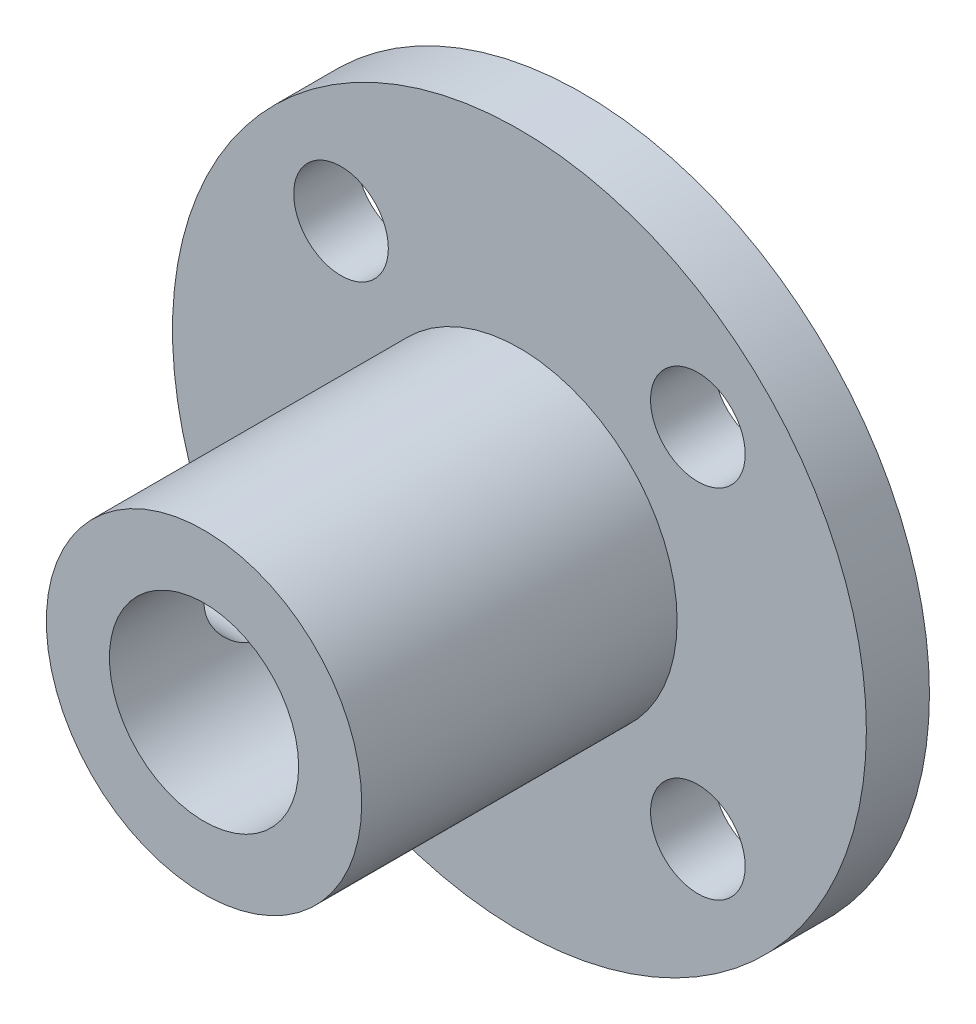
ISO-10303-21;
HEADER;
FILE_DESCRIPTION(('STEP AP214'),'2;1');
FILE_NAME('part.step','',(''),(''),'','','');
FILE_SCHEMA(('AUTOMOTIVE_DESIGN { 1 0 10303 214 1 1 1 1 }'));
ENDSEC;
DATA;
#1=APPLICATION_CONTEXT('core data for automotive mechanical design processes');
#2=APPLICATION_PROTOCOL_DEFINITION('international standard','automotive_design',2000,#1);
#3=PRODUCT_CONTEXT('',#1,'mechanical');
#4=PRODUCT('Part','Part','',(#3));
#5=PRODUCT_RELATED_PRODUCT_CATEGORY('part','',(#4));
#6=PRODUCT_DEFINITION_FORMATION('','',#4);
#7=PRODUCT_DEFINITION_CONTEXT('part definition',#1,'design');
#8=PRODUCT_DEFINITION('design','',#6,#7);
#9=PRODUCT_DEFINITION_SHAPE('','',#8);
#10=(LENGTH_UNIT() NAMED_UNIT(*) SI_UNIT(.MILLI.,.METRE.));
#11=(NAMED_UNIT(*) PLANE_ANGLE_UNIT() SI_UNIT($,.RADIAN.));
#12=(NAMED_UNIT(*) SI_UNIT($,.STERADIAN.) SOLID_ANGLE_UNIT());
#13=UNCERTAINTY_MEASURE_WITH_UNIT(LENGTH_MEASURE(1.E-05),#10,'distance_accuracy_value','');
#14=(GEOMETRIC_REPRESENTATION_CONTEXT(3) GLOBAL_UNCERTAINTY_ASSIGNED_CONTEXT((#13)) GLOBAL_UNIT_ASSIGNED_CONTEXT((#10,
#11,#12)) REPRESENTATION_CONTEXT('',''));
#15=CARTESIAN_POINT('',(0.,0.,0.));
#16=DIRECTION('',(0.,0.,1.));
#17=DIRECTION('',(1.,0.,0.));
#18=AXIS2_PLACEMENT_3D('',#15,#16,#17);
#19=CARTESIAN_POINT('',(0.,0.,2.));
#20=DIRECTION('',(0.,0.,-1.));
#21=DIRECTION('',(-1.,0.,0.));
#22=AXIS2_PLACEMENT_3D('',#19,#20,#21);
#23=CYLINDRICAL_SURFACE('',#22,11.);
#24=CARTESIAN_POINT('',(0.,0.,2.));
#25=DIRECTION('',(0.,0.,1.));
#26=DIRECTION('',(1.,0.,0.));
#27=AXIS2_PLACEMENT_3D('',#24,#25,#26);
#28=CIRCLE('',#27,11.);
#29=CARTESIAN_POINT('',(11.,0.,2.));
#30=VERTEX_POINT('',#29);
#31=EDGE_CURVE('E45',#30,#30,#28,.T.);
#32=ORIENTED_EDGE('',*,*,#31,.F.);
#33=EDGE_LOOP('',(#32));
#34=FACE_BOUND('',#33,.T.);
#35=CARTESIAN_POINT('',(0.,0.,0.));
#36=DIRECTION('',(0.,0.,1.));
#37=DIRECTION('',(1.,0.,0.));
#38=AXIS2_PLACEMENT_3D('',#35,#36,#37);
#39=CIRCLE('',#38,11.);
#40=CARTESIAN_POINT('',(11.,0.,0.));
#41=VERTEX_POINT('',#40);
#42=EDGE_CURVE('E50',#41,#41,#39,.T.);
#43=ORIENTED_EDGE('',*,*,#42,.T.);
#44=EDGE_LOOP('',(#43));
#45=FACE_BOUND('',#44,.T.);
#46=ADVANCED_FACE('F34',(#34,#45),#23,.T.);
#47=CARTESIAN_POINT('',(0.,0.,2.));
#48=DIRECTION('',(0.,0.,1.));
#49=DIRECTION('',(1.,0.,0.));
#50=AXIS2_PLACEMENT_3D('',#47,#48,#49);
#51=PLANE('',#50);
#52=CARTESIAN_POINT('',(-5.65685424949239,5.65685424949206,2.));
#53=DIRECTION('',(0.,0.,1.));
#54=DIRECTION('',(1.,0.,0.));
#55=AXIS2_PLACEMENT_3D('',#52,#53,#54);
#56=CIRCLE('',#55,1.50000000000034);
#57=CARTESIAN_POINT('',(-4.15685424949205,5.65685424949206,2.));
#58=VERTEX_POINT('',#57);
#59=EDGE_CURVE('E82',#58,#58,#56,.T.);
#60=ORIENTED_EDGE('',*,*,#59,.F.);
#61=EDGE_LOOP('',(#60));
#62=FACE_BOUND('',#61,.T.);
#63=CARTESIAN_POINT('',(-5.65685424949205,-5.6568542494927,2.));
#64=DIRECTION('',(0.,0.,1.));
#65=DIRECTION('',(1.,0.,0.));
#66=AXIS2_PLACEMENT_3D('',#63,#64,#65);
#67=CIRCLE('',#66,1.50000000000023);
#68=CARTESIAN_POINT('',(-4.15685424949182,-5.6568542494927,2.));
#69=VERTEX_POINT('',#68);
#70=EDGE_CURVE('E85',#69,#69,#67,.T.);
#71=ORIENTED_EDGE('',*,*,#70,.F.);
#72=EDGE_LOOP('',(#71));
#73=FACE_BOUND('',#72,.T.);
#74=CARTESIAN_POINT('',(5.6568542494927,-5.65685424949237,2.));
#75=DIRECTION('',(0.,0.,1.));
#76=DIRECTION('',(1.,0.,0.));
#77=AXIS2_PLACEMENT_3D('',#74,#75,#76);
#78=CIRCLE('',#77,1.49999999999992);
#79=CARTESIAN_POINT('',(7.15685424949263,-5.65685424949237,2.));
#80=VERTEX_POINT('',#79);
#81=EDGE_CURVE('E81',#80,#80,#78,.T.);
#82=ORIENTED_EDGE('',*,*,#81,.F.);
#83=EDGE_LOOP('',(#82));
#84=FACE_BOUND('',#83,.T.);
#85=CARTESIAN_POINT('',(5.65685424949237,5.65685424949239,2.));
#86=DIRECTION('',(0.,0.,1.));
#87=DIRECTION('',(1.,0.,0.));
#88=AXIS2_PLACEMENT_3D('',#85,#86,#87);
#89=CIRCLE('',#88,1.5);
#90=CARTESIAN_POINT('',(7.15685424949237,5.65685424949239,2.));
#91=VERTEX_POINT('',#90);
#92=EDGE_CURVE('E62',#91,#91,#89,.T.);
#93=ORIENTED_EDGE('',*,*,#92,.F.);
#94=EDGE_LOOP('',(#93));
#95=FACE_BOUND('',#94,.T.);
#96=CARTESIAN_POINT('',(0.,0.,2.));
#97=DIRECTION('',(0.,0.,1.));
#98=DIRECTION('',(1.,0.,0.));
#99=AXIS2_PLACEMENT_3D('',#96,#97,#98);
#100=CIRCLE('',#99,5.);
#101=CARTESIAN_POINT('',(5.,0.,2.));
#102=VERTEX_POINT('',#101);
#103=EDGE_CURVE('E10',#102,#102,#100,.T.);
#104=ORIENTED_EDGE('',*,*,#103,.F.);
#105=EDGE_LOOP('',(#104));
#106=FACE_BOUND('',#105,.T.);
#107=ORIENTED_EDGE('',*,*,#31,.T.);
#108=EDGE_LOOP('',(#107));
#109=FACE_BOUND('',#108,.T.);
#110=ADVANCED_FACE('F135',(#62,#73,#84,#95,#106,#109),#51,.T.);
#111=CARTESIAN_POINT('',(0.,0.,0.));
#112=DIRECTION('',(0.,0.,1.));
#113=DIRECTION('',(1.,0.,0.));
#114=AXIS2_PLACEMENT_3D('',#111,#112,#113);
#115=PLANE('',#114);
#116=CARTESIAN_POINT('',(-5.65685424949239,5.65685424949206,0.));
#117=DIRECTION('',(0.,0.,1.));
#118=DIRECTION('',(1.,0.,0.));
#119=AXIS2_PLACEMENT_3D('',#116,#117,#118);
#120=CIRCLE('',#119,1.50000000000034);
#121=CARTESIAN_POINT('',(-4.15685424949205,5.65685424949206,0.));
#122=VERTEX_POINT('',#121);
#123=EDGE_CURVE('E67',#122,#122,#120,.T.);
#124=ORIENTED_EDGE('',*,*,#123,.T.);
#125=EDGE_LOOP('',(#124));
#126=FACE_BOUND('',#125,.T.);
#127=CARTESIAN_POINT('',(-5.65685424949205,-5.6568542494927,0.));
#128=DIRECTION('',(0.,0.,1.));
#129=DIRECTION('',(1.,0.,0.));
#130=AXIS2_PLACEMENT_3D('',#127,#128,#129);
#131=CIRCLE('',#130,1.50000000000023);
#132=CARTESIAN_POINT('',(-4.15685424949182,-5.6568542494927,0.));
#133=VERTEX_POINT('',#132);
#134=EDGE_CURVE('E65',#133,#133,#131,.T.);
#135=ORIENTED_EDGE('',*,*,#134,.T.);
#136=EDGE_LOOP('',(#135));
#137=FACE_BOUND('',#136,.T.);
#138=CARTESIAN_POINT('',(5.6568542494927,-5.65685424949237,0.));
#139=DIRECTION('',(0.,0.,1.));
#140=DIRECTION('',(1.,0.,0.));
#141=AXIS2_PLACEMENT_3D('',#138,#139,#140);
#142=CIRCLE('',#141,1.49999999999992);
#143=CARTESIAN_POINT('',(7.15685424949263,-5.65685424949237,0.));
#144=VERTEX_POINT('',#143);
#145=EDGE_CURVE('E61',#144,#144,#142,.T.);
#146=ORIENTED_EDGE('',*,*,#145,.T.);
#147=EDGE_LOOP('',(#146));
#148=FACE_BOUND('',#147,.T.);
#149=CARTESIAN_POINT('',(5.65685424949237,5.65685424949239,0.));
#150=DIRECTION('',(0.,0.,1.));
#151=DIRECTION('',(1.,0.,0.));
#152=AXIS2_PLACEMENT_3D('',#149,#150,#151);
#153=CIRCLE('',#152,1.5);
#154=CARTESIAN_POINT('',(7.15685424949237,5.65685424949239,0.));
#155=VERTEX_POINT('',#154);
#156=EDGE_CURVE('E58',#155,#155,#153,.T.);
#157=ORIENTED_EDGE('',*,*,#156,.T.);
#158=EDGE_LOOP('',(#157));
#159=FACE_BOUND('',#158,.T.);
#160=CARTESIAN_POINT('',(0.,0.,0.));
#161=DIRECTION('',(0.,0.,1.));
#162=DIRECTION('',(1.,0.,0.));
#163=AXIS2_PLACEMENT_3D('',#160,#161,#162);
#164=CIRCLE('',#163,3.);
#165=CARTESIAN_POINT('',(3.,0.,0.));
#166=VERTEX_POINT('',#165);
#167=EDGE_CURVE('E69',#166,#166,#164,.T.);
#168=ORIENTED_EDGE('',*,*,#167,.T.);
#169=EDGE_LOOP('',(#168));
#170=FACE_BOUND('',#169,.T.);
#171=ORIENTED_EDGE('',*,*,#42,.F.);
#172=EDGE_LOOP('',(#171));
#173=FACE_BOUND('',#172,.T.);
#174=ADVANCED_FACE('F130',(#126,#137,#148,#159,#170,#173),#115,.F.);
#175=CARTESIAN_POINT('',(0.,0.,12.));
#176=DIRECTION('',(0.,0.,-1.));
#177=DIRECTION('',(-1.,0.,0.));
#178=AXIS2_PLACEMENT_3D('',#175,#176,#177);
#179=CYLINDRICAL_SURFACE('',#178,5.);
#180=CARTESIAN_POINT('',(-5.,0.,9.));
#181=CARTESIAN_POINT('',(-4.9999992925055,-0.0822886127532999,8.99999900251511));
#182=CARTESIAN_POINT('',(-4.99794915693954,-0.164587318351529,8.99320613637603));
#183=CARTESIAN_POINT('',(-4.98997105593691,-0.32678812530488,8.9662786457779));
#184=CARTESIAN_POINT('',(-4.98404193389692,-0.40668950441142,8.94614004197666));
#185=CARTESIAN_POINT('',(-4.96895552501836,-0.561732707754526,8.89325398308974));
#186=CARTESIAN_POINT('',(-4.95980300250425,-0.636881364395372,8.86052513038106));
#187=CARTESIAN_POINT('',(-4.93922109237645,-0.78062418105313,8.78346390694416));
#188=CARTESIAN_POINT('',(-4.92779140192067,-0.849217467469668,8.73912999260458));
#189=CARTESIAN_POINT('',(-4.90350737192774,-0.979871797183744,8.63877599252733));
#190=CARTESIAN_POINT('',(-4.89062383657036,-1.04171807124434,8.58248337411409));
#191=CARTESIAN_POINT('',(-4.86505834210442,-1.15524920923324,8.46039077008982));
#192=CARTESIAN_POINT('',(-4.85237641724501,-1.20693236327441,8.39458918787504));
#193=CARTESIAN_POINT('',(-4.82834113993772,-1.29980037723708,8.25352924696239));
#194=CARTESIAN_POINT('',(-4.81702406663875,-1.34072309022213,8.17809153900926));
#195=CARTESIAN_POINT('',(-4.79743620394031,-1.4092139477476,8.02101074576971));
#196=CARTESIAN_POINT('',(-4.78916468313311,-1.43678529919973,7.93936915607203));
#197=CARTESIAN_POINT('',(-4.77690870838434,-1.47701633682652,7.77460973386954));
#198=CARTESIAN_POINT('',(-4.77281069324533,-1.49007196234677,7.69159725613606));
#199=CARTESIAN_POINT('',(-4.76902789749767,-1.50213730614672,7.52446684378324));
#200=CARTESIAN_POINT('',(-4.76934204760571,-1.50115042761078,7.44034918194091));
#201=CARTESIAN_POINT('',(-4.77424744067778,-1.48546977199812,7.27661609139152));
#202=CARTESIAN_POINT('',(-4.7786838859914,-1.47127205262685,7.19694774963776));
#203=CARTESIAN_POINT('',(-4.79108356228624,-1.43037420427056,7.04118021372654));
#204=CARTESIAN_POINT('',(-4.79904714132351,-1.40367284141641,6.96508137262567));
#205=CARTESIAN_POINT('',(-4.81772733074973,-1.33816026653682,6.81739965033926));
#206=CARTESIAN_POINT('',(-4.82848016115952,-1.29918816934643,6.74589291604474));
#207=CARTESIAN_POINT('',(-4.85150987000064,-1.21035222588683,6.61026797798981));
#208=CARTESIAN_POINT('',(-4.86378711746991,-1.16048574002589,6.54615157058622));
#209=CARTESIAN_POINT('',(-4.88911011297937,-1.04881290765547,6.42431380923798));
#210=CARTESIAN_POINT('',(-4.90216654310498,-0.986594907466974,6.36697133597033));
#211=CARTESIAN_POINT('',(-4.92712244063259,-0.853263259313968,6.26344601593575));
#212=CARTESIAN_POINT('',(-4.9390218351841,-0.782149051860889,6.21726387158557));
#213=CARTESIAN_POINT('',(-4.9604316006947,-0.632355038342804,6.13714007753527));
#214=CARTESIAN_POINT('',(-4.96992543668314,-0.553627749747951,6.10328248375014));
#215=CARTESIAN_POINT('',(-4.98533521832222,-0.39124541560352,6.04940040990037));
#216=CARTESIAN_POINT('',(-4.99125216186999,-0.307591751589583,6.02937207146751));
#217=CARTESIAN_POINT('',(-4.99868364643538,-0.140952242668333,6.00434782210061));
#218=CARTESIAN_POINT('',(-5.0003485041779,-0.0580500976011886,5.99883841419839));
#219=CARTESIAN_POINT('',(-4.9995292324176,0.107499605823381,6.00156915571208));
#220=CARTESIAN_POINT('',(-4.99704565677756,0.190147196690779,6.00980746965144));
#221=CARTESIAN_POINT('',(-4.98830696987163,0.350903605309695,6.0393846111115));
#222=CARTESIAN_POINT('',(-4.98213829799417,0.429072772614167,6.06042338758087));
#223=CARTESIAN_POINT('',(-4.96674347841533,0.58075463895452,6.1146432327782));
#224=CARTESIAN_POINT('',(-4.95751696321085,0.654266777025582,6.14782576103786));
#225=CARTESIAN_POINT('',(-4.93669654351325,0.79643718946105,6.22625316548113));
#226=CARTESIAN_POINT('',(-4.92505280829675,0.864943826199667,6.27175934094797));
#227=CARTESIAN_POINT('',(-4.90073468764318,0.993523307980144,6.37322475405281));
#228=CARTESIAN_POINT('',(-4.8880600443108,1.05359403235593,6.42918661188767));
#229=CARTESIAN_POINT('',(-4.86253171869138,1.16585744551027,6.55238730836934));
#230=CARTESIAN_POINT('',(-4.84968825033268,1.21768481231503,6.61996187577174));
#231=CARTESIAN_POINT('',(-4.82576515238463,1.30928995072153,6.76312793901353));
#232=CARTESIAN_POINT('',(-4.81468547654651,1.34906803829472,6.83871922455821));
#233=CARTESIAN_POINT('',(-4.79567189615055,1.41517347127168,6.99553249125469));
#234=CARTESIAN_POINT('',(-4.78772337843827,1.4415634693705,7.07672618653659));
#235=CARTESIAN_POINT('',(-4.77591594362794,1.48021730815114,7.24268796893148));
#236=CARTESIAN_POINT('',(-4.772055625083,1.49248598978779,7.32745482078767));
#237=CARTESIAN_POINT('',(-4.76899972496087,1.50221984485059,7.49436151837623));
#238=CARTESIAN_POINT('',(-4.76961647442754,1.5002805530849,7.57646365101758));
#239=CARTESIAN_POINT('',(-4.77499401288294,1.48307505444813,7.7391141033728));
#240=CARTESIAN_POINT('',(-4.77975463592551,1.46780938124716,7.81966248517635));
#241=CARTESIAN_POINT('',(-4.79275763670386,1.42476888804136,7.97594539914285));
#242=CARTESIAN_POINT('',(-4.80095604545965,1.39715175507068,8.05172728736169));
#243=CARTESIAN_POINT('',(-4.81990278909136,1.33031507121129,8.19764243881772));
#244=CARTESIAN_POINT('',(-4.83065161194312,1.29109329962876,8.26777461764076));
#245=CARTESIAN_POINT('',(-4.85397676425833,1.20048763805072,8.40316311652711));
#246=CARTESIAN_POINT('',(-4.86660540163798,1.14871276092994,8.46814876126041));
#247=CARTESIAN_POINT('',(-4.89201320450026,1.03517434629782,8.58870249830786));
#248=CARTESIAN_POINT('',(-4.90479240823905,0.9734082171345,8.64426813946775));
#249=CARTESIAN_POINT('',(-4.92950936570649,0.839465762183247,8.74602341229503));
#250=CARTESIAN_POINT('',(-4.94141159765674,0.767037885790607,8.79189144685549));
#251=CARTESIAN_POINT('',(-4.96260680455813,0.615141373983529,8.87073516990402));
#252=CARTESIAN_POINT('',(-4.97190099931067,0.535676052998955,8.90371688827451));
#253=CARTESIAN_POINT('',(-4.98602174969301,0.380757712655281,8.95289527565275));
#254=CARTESIAN_POINT('',(-4.99122027381068,0.305786961954234,8.97051167288325));
#255=CARTESIAN_POINT('',(-4.99820944494492,0.153880195230779,8.99406352524158));
#256=CARTESIAN_POINT('',(-5.0000006615474,0.0769445098581395,9.00000093270482));
#257=CARTESIAN_POINT('',(-5.,0.,9.));
#258=B_SPLINE_CURVE_WITH_KNOTS('',3,(#180,#181,#182,#183,#184,#185,#186,#187,#188,#189,#190,
#191,#192,#193,#194,#195,#196,#197,#198,#199,#200,#201,#202,#203,#204,#205,#206,#207,#208,#209,
#210,#211,#212,#213,#214,#215,#216,#217,#218,#219,#220,#221,#222,#223,#224,#225,#226,#227,#228,
#229,#230,#231,#232,#233,#234,#235,#236,#237,#238,#239,#240,#241,#242,#243,#244,#245,#246,#247,
#248,#249,#250,#251,#252,#253,#254,#255,#256,#257),.UNSPECIFIED.,.T.,.F.,(4,2,2,2,2,2,2,2,2,2,2,
2,2,2,2,2,2,2,2,2,2,2,2,2,2,2,2,2,2,2,2,2,2,2,2,2,2,2,4),(0.,0.24658320361261,0.493239964845999,
0.739533676300873,0.9858601644127,1.23855602948191,1.49129437288633,1.74971481004109,
2.00807314543223,2.25919689356599,2.51025978319089,2.75226016697676,2.99428443658001,
3.23962426447119,3.48502360158555,3.74067104048166,3.99633456531071,4.25371046881689,
4.51101453528808,4.75908809438545,5.00712853550327,5.24956746682327,5.49203554593728,
5.74011305702908,5.98825282000191,6.24540400322818,6.5025484425268,6.75847814951252,
7.01432009460283,7.25950155466942,7.504673196616,7.74680040402721,7.98897397553107,
8.2399692567993,8.49102974897502,8.7494299615667,9.00770911595235,9.23831691930459,
9.46888616948874),.UNSPECIFIED.);
#259=CARTESIAN_POINT('',(-5.,0.,9.));
#260=VERTEX_POINT('',#259);
#261=EDGE_CURVE('E86',#260,#260,#258,.T.);
#262=ORIENTED_EDGE('',*,*,#261,.T.);
#263=EDGE_LOOP('',(#262));
#264=FACE_BOUND('',#263,.T.);
#265=CARTESIAN_POINT('',(0.,0.,12.));
#266=DIRECTION('',(0.,0.,1.));
#267=DIRECTION('',(1.,0.,0.));
#268=AXIS2_PLACEMENT_3D('',#265,#266,#267);
#269=CIRCLE('',#268,5.);
#270=CARTESIAN_POINT('',(5.,0.,12.));
#271=VERTEX_POINT('',#270);
#272=EDGE_CURVE('E53',#271,#271,#269,.T.);
#273=ORIENTED_EDGE('',*,*,#272,.F.);
#274=EDGE_LOOP('',(#273));
#275=FACE_BOUND('',#274,.T.);
#276=ORIENTED_EDGE('',*,*,#103,.T.);
#277=EDGE_LOOP('',(#276));
#278=FACE_BOUND('',#277,.T.);
#279=ADVANCED_FACE('F95',(#264,#275,#278),#179,.T.);
#280=CARTESIAN_POINT('',(0.,0.,12.));
#281=DIRECTION('',(0.,0.,1.));
#282=DIRECTION('',(1.,0.,0.));
#283=AXIS2_PLACEMENT_3D('',#280,#281,#282);
#284=PLANE('',#283);
#285=CARTESIAN_POINT('',(0.,0.,12.));
#286=DIRECTION('',(0.,0.,1.));
#287=DIRECTION('',(1.,0.,0.));
#288=AXIS2_PLACEMENT_3D('',#285,#286,#287);
#289=CIRCLE('',#288,3.);
#290=CARTESIAN_POINT('',(3.,0.,12.));
#291=VERTEX_POINT('',#290);
#292=EDGE_CURVE('E73',#291,#291,#289,.T.);
#293=ORIENTED_EDGE('',*,*,#292,.F.);
#294=EDGE_LOOP('',(#293));
#295=FACE_BOUND('',#294,.T.);
#296=ORIENTED_EDGE('',*,*,#272,.T.);
#297=EDGE_LOOP('',(#296));
#298=FACE_BOUND('',#297,.T.);
#299=ADVANCED_FACE('F123',(#295,#298),#284,.T.);
#300=CARTESIAN_POINT('',(0.,0.,12.));
#301=DIRECTION('',(0.,0.,-1.));
#302=DIRECTION('',(-1.,0.,0.));
#303=AXIS2_PLACEMENT_3D('',#300,#301,#302);
#304=CYLINDRICAL_SURFACE('',#303,3.);
#305=CARTESIAN_POINT('',(-3.,0.,9.));
#306=CARTESIAN_POINT('',(-2.99999570107562,-0.0788579444268502,8.99999504652421));
#307=CARTESIAN_POINT('',(-2.99685736529635,-0.157809899546344,8.99374489031842));
#308=CARTESIAN_POINT('',(-2.98461234055736,-0.313380352903344,8.96902067948769));
#309=CARTESIAN_POINT('',(-2.97549431743379,-0.389994130070444,8.95052341050328));
#310=CARTESIAN_POINT('',(-2.95224419105063,-0.538400317320673,8.90220928707506));
#311=CARTESIAN_POINT('',(-2.93813158766306,-0.61021020440872,8.87243642362805));
#312=CARTESIAN_POINT('',(-2.90618664773642,-0.747708925209898,8.80264406795252));
#313=CARTESIAN_POINT('',(-2.88835460450288,-0.813398240985088,8.7626253836267));
#314=CARTESIAN_POINT('',(-2.84934387387093,-0.941261726642864,8.67072412577207));
#315=CARTESIAN_POINT('',(-2.82802798691306,-1.00298281668316,8.61827028114054));
#316=CARTESIAN_POINT('',(-2.78489955370115,-1.11716916730047,8.50421778112944));
#317=CARTESIAN_POINT('',(-2.76308664313552,-1.16962737466015,8.44261222234134));
#318=CARTESIAN_POINT('',(-2.71948426796021,-1.26787800067542,8.30627497571493));
#319=CARTESIAN_POINT('',(-2.69782780455198,-1.31283800332746,8.23089585248113));
#320=CARTESIAN_POINT('',(-2.65928968158481,-1.38925234033604,8.07244899602068));
#321=CARTESIAN_POINT('',(-2.64240461410484,-1.4207163224495,7.98938680691588));
#322=CARTESIAN_POINT('',(-2.61686800556713,-1.46719866328288,7.82300234186711));
#323=CARTESIAN_POINT('',(-2.6077840737557,-1.48308878562066,7.73999332189891));
#324=CARTESIAN_POINT('',(-2.59772834922792,-1.50064048996327,7.57203174333078));
#325=CARTESIAN_POINT('',(-2.59674854014932,-1.50231613255961,7.48708118869327));
#326=CARTESIAN_POINT('',(-2.60266395385873,-1.49203093075844,7.32857096352695));
#327=CARTESIAN_POINT('',(-2.6086314549302,-1.48167683930523,7.25486395316543));
#328=CARTESIAN_POINT('',(-2.62614343100775,-1.4504097735854,7.11041713594044));
#329=CARTESIAN_POINT('',(-2.63768968247664,-1.42949343584648,7.03967828204203));
#330=CARTESIAN_POINT('',(-2.66531214619112,-1.37731467057901,6.90115630115151));
#331=CARTESIAN_POINT('',(-2.68148760995998,-1.34582260067399,6.83348040182132));
#332=CARTESIAN_POINT('',(-2.71655106422105,-1.273562531502,6.70404856111499));
#333=CARTESIAN_POINT('',(-2.73544027170286,-1.2327903657187,6.64229529659987));
#334=CARTESIAN_POINT('',(-2.77669736854929,-1.13709908236918,6.51821812088516));
#335=CARTESIAN_POINT('',(-2.79920265355119,-1.08104168755392,6.45681468963577));
#336=CARTESIAN_POINT('',(-2.84321434950611,-0.959333368112062,6.34389687211365));
#337=CARTESIAN_POINT('',(-2.86472027938201,-0.89367788486143,6.29238721194918));
#338=CARTESIAN_POINT('',(-2.90552980924446,-0.750774758747775,6.19847150845541));
#339=CARTESIAN_POINT('',(-2.92468476243011,-0.673130387399115,6.15659929133139));
#340=CARTESIAN_POINT('',(-2.95736821681863,-0.510699323233197,6.08685445643549));
#341=CARTESIAN_POINT('',(-2.9709011841533,-0.425918364397916,6.05897072247725));
#342=CARTESIAN_POINT('',(-2.98986500612153,-0.259149737491056,6.02028689442499));
#343=CARTESIAN_POINT('',(-2.99587407451965,-0.177512295822492,6.00826314637983));
#344=CARTESIAN_POINT('',(-3.00109520188655,-0.0131693999240299,5.99780290329827));
#345=CARTESIAN_POINT('',(-3.00031048081978,0.0695355298048606,5.9993599715408));
#346=CARTESIAN_POINT('',(-2.99236788380152,0.226849457978978,6.01531003262812));
#347=CARTESIAN_POINT('',(-2.98570868532253,0.301589112074892,6.02869879909499));
#348=CARTESIAN_POINT('',(-2.9673325697226,0.447610338452909,6.06635710784268));
#349=CARTESIAN_POINT('',(-2.95561509501618,0.518891528536628,6.09062784968024));
#350=CARTESIAN_POINT('',(-2.92776377120382,0.658332912674356,6.14999769964955));
#351=CARTESIAN_POINT('',(-2.91151322654446,0.726345595508702,6.18538657517443));
#352=CARTESIAN_POINT('',(-2.87615961476127,0.855692042548904,6.26566130346985));
#353=CARTESIAN_POINT('',(-2.85705533350408,0.917022944664884,6.31055120189309));
#354=CARTESIAN_POINT('',(-2.81562332004297,1.03765153393382,6.41364063799607));
#355=CARTESIAN_POINT('',(-2.79316327265249,1.09615811672854,6.47271430266772));
#356=CARTESIAN_POINT('',(-2.7489358741323,1.20278448167828,6.59988772691659));
#357=CARTESIAN_POINT('',(-2.72716901100071,1.25089707856781,6.66799367827188));
#358=CARTESIAN_POINT('',(-2.68576788309734,1.33756187171852,6.81546548125946));
#359=CARTESIAN_POINT('',(-2.66628794383591,1.37553824370037,6.89521689914172));
#360=CARTESIAN_POINT('',(-2.63361108441202,1.43712423890205,7.06126510136245));
#361=CARTESIAN_POINT('',(-2.62040607332625,1.46075237380052,7.14755328970033));
#362=CARTESIAN_POINT('',(-2.60342251538703,1.49079253120031,7.31536533432705));
#363=CARTESIAN_POINT('',(-2.59886075197597,1.49863949460818,7.39655138015286));
#364=CARTESIAN_POINT('',(-2.59748031962405,1.5010337315643,7.55917060074679));
#365=CARTESIAN_POINT('',(-2.60065829439585,1.49558676993486,7.64060365310679));
#366=CARTESIAN_POINT('',(-2.61356793076615,1.47288918838996,7.79322525230015));
#367=CARTESIAN_POINT('',(-2.62264641723988,1.45681247151455,7.86465070521711));
#368=CARTESIAN_POINT('',(-2.64556524281479,1.41476303733662,8.00371217913655));
#369=CARTESIAN_POINT('',(-2.65940711354503,1.38878713673988,8.07134697313804));
#370=CARTESIAN_POINT('',(-2.69142795546804,1.32572361795085,8.2059372764798));
#371=CARTESIAN_POINT('',(-2.70983583593881,1.28800670672355,8.27254185274354));
#372=CARTESIAN_POINT('',(-2.74852997452291,1.20322645745609,8.39891180427188));
#373=CARTESIAN_POINT('',(-2.76881720693416,1.15615825686234,8.45867359578167));
#374=CARTESIAN_POINT('',(-2.81193484737138,1.04730498999206,8.57721297353201));
#375=CARTESIAN_POINT('',(-2.83477474959942,0.984426634495891,8.63498865352543));
#376=CARTESIAN_POINT('',(-2.87816628389896,0.849232209349796,8.7393944751529));
#377=CARTESIAN_POINT('',(-2.89871667939293,0.776911084957796,8.78601860920486));
#378=CARTESIAN_POINT('',(-2.93547014349806,0.623897395174419,8.8668545440681));
#379=CARTESIAN_POINT('',(-2.95164144740899,0.543149255665096,8.9009762538547));
#380=CARTESIAN_POINT('',(-2.9775201194848,0.37611315170713,8.95471225163611));
#381=CARTESIAN_POINT('',(-2.98724585044602,0.289841699383651,8.97436777020857));
#382=CARTESIAN_POINT('',(-2.99543192870217,0.168902919736343,8.99084611662861));
#383=CARTESIAN_POINT('',(-2.99714048010376,0.135242819162347,8.99427396129951));
#384=CARTESIAN_POINT('',(-2.99942545465223,0.0677275977076371,8.99885199827113));
#385=CARTESIAN_POINT('',(-3.00000184655071,0.0338724714699425,9.00000212770531));
#386=CARTESIAN_POINT('',(-3.,0.,9.));
#387=B_SPLINE_CURVE_WITH_KNOTS('',3,(#305,#306,#307,#308,#309,#310,#311,#312,#313,#314,#315,
#316,#317,#318,#319,#320,#321,#322,#323,#324,#325,#326,#327,#328,#329,#330,#331,#332,#333,#334,
#335,#336,#337,#338,#339,#340,#341,#342,#343,#344,#345,#346,#347,#348,#349,#350,#351,#352,#353,
#354,#355,#356,#357,#358,#359,#360,#361,#362,#363,#364,#365,#366,#367,#368,#369,#370,#371,#372,
#373,#374,#375,#376,#377,#378,#379,#380,#381,#382,#383,#384,#385,#386),.UNSPECIFIED.,.T.,.F.,(4,
2,2,2,2,2,2,2,2,2,2,2,2,2,2,2,2,2,2,2,2,2,2,2,2,2,2,2,2,2,2,2,2,2,2,2,2,2,2,2,4),(0.,
0.236436386130439,0.473322224563796,0.709293233238448,0.945245640872351,1.19547263807713,
1.44588935648105,1.71572589646129,1.98536921847421,2.23887018210344,2.49212035993531,
2.71508568613981,2.93812205888518,3.16635360252731,3.39468781890333,3.65197412000817,
3.90938301898029,4.17874533321661,4.44789325368419,4.69474935707018,4.94148846767214,
5.16910359759183,5.39674382446397,5.63089284041848,5.86514176122509,6.12239415966628,
6.37982382923147,6.64972023242588,6.91926767918176,7.16293961254569,7.40650589797017,
7.62686895373283,7.84730293182526,8.0825468517043,8.31791341715446,8.58187864135757,
8.84598575071868,9.1119602049529,9.37717362931723,9.47872920200875,9.58028757766599),.UNSPECIFIED.);
#388=CARTESIAN_POINT('',(-3.,0.,9.));
#389=VERTEX_POINT('',#388);
#390=EDGE_CURVE('E37',#389,#389,#387,.T.);
#391=ORIENTED_EDGE('',*,*,#390,.F.);
#392=EDGE_LOOP('',(#391));
#393=FACE_BOUND('',#392,.T.);
#394=ORIENTED_EDGE('',*,*,#292,.T.);
#395=EDGE_LOOP('',(#394));
#396=FACE_BOUND('',#395,.T.);
#397=ORIENTED_EDGE('',*,*,#167,.F.);
#398=EDGE_LOOP('',(#397));
#399=FACE_BOUND('',#398,.T.);
#400=ADVANCED_FACE('F119',(#393,#396,#399),#304,.F.);
#401=CARTESIAN_POINT('',(5.65685424949237,5.65685424949239,-8.));
#402=DIRECTION('',(0.,0.,1.));
#403=DIRECTION('',(1.,0.,0.));
#404=AXIS2_PLACEMENT_3D('',#401,#402,#403);
#405=CYLINDRICAL_SURFACE('',#404,1.5);
#406=ORIENTED_EDGE('',*,*,#92,.T.);
#407=EDGE_LOOP('',(#406));
#408=FACE_BOUND('',#407,.T.);
#409=ORIENTED_EDGE('',*,*,#156,.F.);
#410=EDGE_LOOP('',(#409));
#411=FACE_BOUND('',#410,.T.);
#412=ADVANCED_FACE('F110',(#408,#411),#405,.F.);
#413=CARTESIAN_POINT('',(5.6568542494927,-5.65685424949237,-8.));
#414=DIRECTION('',(0.,0.,1.));
#415=DIRECTION('',(1.,0.,0.));
#416=AXIS2_PLACEMENT_3D('',#413,#414,#415);
#417=CYLINDRICAL_SURFACE('',#416,1.49999999999992);
#418=ORIENTED_EDGE('',*,*,#81,.T.);
#419=EDGE_LOOP('',(#418));
#420=FACE_BOUND('',#419,.T.);
#421=ORIENTED_EDGE('',*,*,#145,.F.);
#422=EDGE_LOOP('',(#421));
#423=FACE_BOUND('',#422,.T.);
#424=ADVANCED_FACE('F105',(#420,#423),#417,.F.);
#425=CARTESIAN_POINT('',(-5.65685424949205,-5.6568542494927,-8.));
#426=DIRECTION('',(0.,0.,1.));
#427=DIRECTION('',(1.,0.,0.));
#428=AXIS2_PLACEMENT_3D('',#425,#426,#427);
#429=CYLINDRICAL_SURFACE('',#428,1.50000000000023);
#430=ORIENTED_EDGE('',*,*,#70,.T.);
#431=EDGE_LOOP('',(#430));
#432=FACE_BOUND('',#431,.T.);
#433=ORIENTED_EDGE('',*,*,#134,.F.);
#434=EDGE_LOOP('',(#433));
#435=FACE_BOUND('',#434,.T.);
#436=ADVANCED_FACE('F109',(#432,#435),#429,.F.);
#437=CARTESIAN_POINT('',(-5.65685424949239,5.65685424949206,-8.));
#438=DIRECTION('',(0.,0.,1.));
#439=DIRECTION('',(1.,0.,0.));
#440=AXIS2_PLACEMENT_3D('',#437,#438,#439);
#441=CYLINDRICAL_SURFACE('',#440,1.50000000000034);
#442=ORIENTED_EDGE('',*,*,#59,.T.);
#443=EDGE_LOOP('',(#442));
#444=FACE_BOUND('',#443,.T.);
#445=ORIENTED_EDGE('',*,*,#123,.F.);
#446=EDGE_LOOP('',(#445));
#447=FACE_BOUND('',#446,.T.);
#448=ADVANCED_FACE('F103',(#444,#447),#441,.F.);
#449=CARTESIAN_POINT('',(-11.,0.,7.5));
#450=DIRECTION('',(1.,0.,0.));
#451=DIRECTION('',(0.,0.,-1.));
#452=AXIS2_PLACEMENT_3D('',#449,#450,#451);
#453=CYLINDRICAL_SURFACE('',#452,1.5);
#454=ORIENTED_EDGE('',*,*,#390,.T.);
#455=EDGE_LOOP('',(#454));
#456=FACE_BOUND('',#455,.T.);
#457=ORIENTED_EDGE('',*,*,#261,.F.);
#458=EDGE_LOOP('',(#457));
#459=FACE_BOUND('',#458,.T.);
#460=ADVANCED_FACE('F99',(#456,#459),#453,.F.);
#461=CLOSED_SHELL('',(#46,#110,#174,#279,#299,#400,#412,#424,#436,#448,#460));
#462=MANIFOLD_SOLID_BREP('B2',#461);
#463=ADVANCED_BREP_SHAPE_REPRESENTATION('',(#18,#462),#14);
#464=SHAPE_DEFINITION_REPRESENTATION(#9,#463);
ENDSEC;
END-ISO-10303-21;
